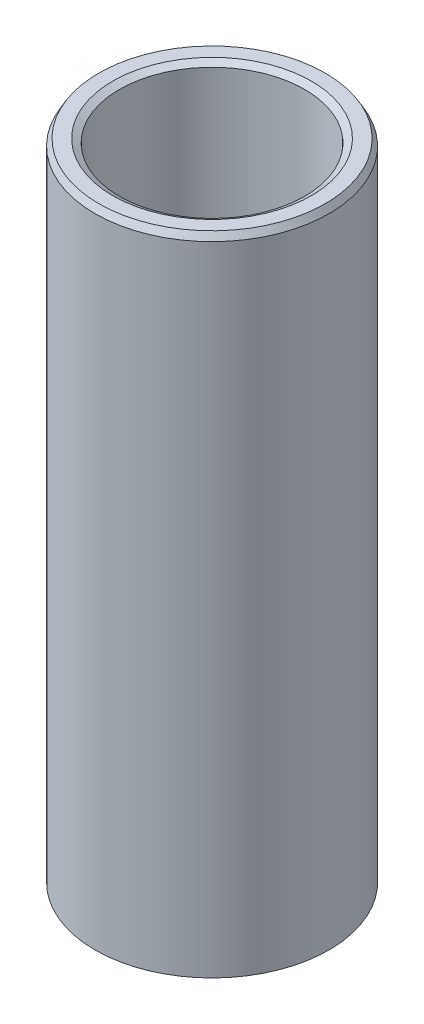
ISO-10303-21;
HEADER;
FILE_DESCRIPTION(('STEP AP214'),'2;1');
FILE_NAME('part.step','',(''),(''),'','','');
FILE_SCHEMA(('AUTOMOTIVE_DESIGN { 1 0 10303 214 1 1 1 1 }'));
ENDSEC;
DATA;
#1=APPLICATION_CONTEXT('core data for automotive mechanical design processes');
#2=APPLICATION_PROTOCOL_DEFINITION('international standard','automotive_design',2000,#1);
#3=PRODUCT_CONTEXT('',#1,'mechanical');
#4=PRODUCT('Part','Part','',(#3));
#5=PRODUCT_RELATED_PRODUCT_CATEGORY('part','',(#4));
#6=PRODUCT_DEFINITION_FORMATION('','',#4);
#7=PRODUCT_DEFINITION_CONTEXT('part definition',#1,'design');
#8=PRODUCT_DEFINITION('design','',#6,#7);
#9=PRODUCT_DEFINITION_SHAPE('','',#8);
#10=(LENGTH_UNIT() NAMED_UNIT(*) SI_UNIT(.MILLI.,.METRE.));
#11=(NAMED_UNIT(*) PLANE_ANGLE_UNIT() SI_UNIT($,.RADIAN.));
#12=(NAMED_UNIT(*) SI_UNIT($,.STERADIAN.) SOLID_ANGLE_UNIT());
#13=UNCERTAINTY_MEASURE_WITH_UNIT(LENGTH_MEASURE(1.E-05),#10,'distance_accuracy_value','');
#14=(GEOMETRIC_REPRESENTATION_CONTEXT(3) GLOBAL_UNCERTAINTY_ASSIGNED_CONTEXT((#13)) GLOBAL_UNIT_ASSIGNED_CONTEXT((#10,
#11,#12)) REPRESENTATION_CONTEXT('',''));
#15=CARTESIAN_POINT('',(0.,0.,0.));
#16=DIRECTION('',(0.,0.,1.));
#17=DIRECTION('',(1.,0.,0.));
#18=AXIS2_PLACEMENT_3D('',#15,#16,#17);
#19=CARTESIAN_POINT('',(0.,276.908699703213,0.));
#20=DIRECTION('',(0.,-1.,0.));
#21=DIRECTION('',(0.,0.,-1.));
#22=AXIS2_PLACEMENT_3D('',#19,#20,#21);
#23=CYLINDRICAL_SURFACE('',#22,50.);
#24=CARTESIAN_POINT('',(0.,1.64700059738854,0.));
#25=DIRECTION('',(0.,1.,0.));
#26=DIRECTION('',(0.,0.,1.));
#27=AXIS2_PLACEMENT_3D('',#24,#25,#26);
#28=CIRCLE('',#27,50.);
#29=CARTESIAN_POINT('',(0.,1.64700059738854,50.));
#30=VERTEX_POINT('',#29);
#31=EDGE_CURVE('E10',#30,#30,#28,.T.);
#32=ORIENTED_EDGE('',*,*,#31,.T.);
#33=EDGE_LOOP('',(#32));
#34=FACE_BOUND('',#33,.T.);
#35=CARTESIAN_POINT('',(0.,274.05601098844,0.));
#36=DIRECTION('',(0.,1.,0.));
#37=DIRECTION('',(0.,0.,1.));
#38=AXIS2_PLACEMENT_3D('',#35,#36,#37);
#39=CIRCLE('',#38,50.);
#40=CARTESIAN_POINT('',(0.,274.05601098844,50.));
#41=VERTEX_POINT('',#40);
#42=EDGE_CURVE('E50',#41,#41,#39,.F.);
#43=ORIENTED_EDGE('',*,*,#42,.T.);
#44=EDGE_LOOP('',(#43));
#45=FACE_BOUND('',#44,.T.);
#46=ADVANCED_FACE('F39',(#34,#45),#23,.T.);
#47=CARTESIAN_POINT('',(0.,276.908699703213,0.));
#48=DIRECTION('',(0.,1.,0.));
#49=DIRECTION('',(0.,0.,1.));
#50=AXIS2_PLACEMENT_3D('',#47,#48,#49);
#51=PLANE('',#50);
#52=CARTESIAN_POINT('',(0.,276.908699703213,0.));
#53=DIRECTION('',(0.,1.,0.));
#54=DIRECTION('',(0.,0.,1.));
#55=AXIS2_PLACEMENT_3D('',#52,#53,#54);
#56=CIRCLE('',#55,42.4172819836385);
#57=CARTESIAN_POINT('',(0.,276.908699703213,42.4172819836385));
#58=VERTEX_POINT('',#57);
#59=EDGE_CURVE('E58',#58,#58,#56,.F.);
#60=ORIENTED_EDGE('',*,*,#59,.T.);
#61=EDGE_LOOP('',(#60));
#62=FACE_BOUND('',#61,.T.);
#63=CARTESIAN_POINT('',(0.,276.908699703213,0.));
#64=DIRECTION('',(0.,1.,0.));
#65=DIRECTION('',(0.,0.,1.));
#66=AXIS2_PLACEMENT_3D('',#63,#64,#65);
#67=CIRCLE('',#66,48.3529994026114);
#68=CARTESIAN_POINT('',(0.,276.908699703213,48.3529994026114));
#69=VERTEX_POINT('',#68);
#70=EDGE_CURVE('E61',#69,#69,#67,.T.);
#71=ORIENTED_EDGE('',*,*,#70,.T.);
#72=EDGE_LOOP('',(#71));
#73=FACE_BOUND('',#72,.T.);
#74=ADVANCED_FACE('F88',(#62,#73),#51,.T.);
#75=CARTESIAN_POINT('',(0.,0.,0.));
#76=DIRECTION('',(0.,1.,0.));
#77=DIRECTION('',(0.,0.,1.));
#78=AXIS2_PLACEMENT_3D('',#75,#76,#77);
#79=PLANE('',#78);
#80=CARTESIAN_POINT('',(0.,0.,0.));
#81=DIRECTION('',(0.,1.,0.));
#82=DIRECTION('',(0.,0.,1.));
#83=AXIS2_PLACEMENT_3D('',#80,#81,#82);
#84=CIRCLE('',#83,41.2115938662539);
#85=CARTESIAN_POINT('',(0.,0.,41.2115938662539));
#86=VERTEX_POINT('',#85);
#87=EDGE_CURVE('E51',#86,#86,#84,.T.);
#88=ORIENTED_EDGE('',*,*,#87,.T.);
#89=EDGE_LOOP('',(#88));
#90=FACE_BOUND('',#89,.T.);
#91=CARTESIAN_POINT('',(0.,0.,0.));
#92=DIRECTION('',(0.,1.,0.));
#93=DIRECTION('',(0.,0.,1.));
#94=AXIS2_PLACEMENT_3D('',#91,#92,#93);
#95=CIRCLE('',#94,47.1473112852268);
#96=CARTESIAN_POINT('',(0.,0.,47.1473112852268));
#97=VERTEX_POINT('',#96);
#98=EDGE_CURVE('E54',#97,#97,#95,.F.);
#99=ORIENTED_EDGE('',*,*,#98,.T.);
#100=EDGE_LOOP('',(#99));
#101=FACE_BOUND('',#100,.T.);
#102=ADVANCED_FACE('F83',(#90,#101),#79,.F.);
#103=CARTESIAN_POINT('',(0.,276.908699703213,0.));
#104=DIRECTION('',(0.,-1.,0.));
#105=DIRECTION('',(0.,0.,-1.));
#106=AXIS2_PLACEMENT_3D('',#103,#104,#105);
#107=CYLINDRICAL_SURFACE('',#106,39.5645932688654);
#108=CARTESIAN_POINT('',(0.,275.261699105825,0.));
#109=DIRECTION('',(0.,1.,0.));
#110=DIRECTION('',(0.,0.,1.));
#111=AXIS2_PLACEMENT_3D('',#108,#109,#110);
#112=CIRCLE('',#111,39.5645932688654);
#113=CARTESIAN_POINT('',(0.,275.261699105825,39.5645932688654));
#114=VERTEX_POINT('',#113);
#115=EDGE_CURVE('E67',#114,#114,#112,.T.);
#116=ORIENTED_EDGE('',*,*,#115,.T.);
#117=EDGE_LOOP('',(#116));
#118=FACE_BOUND('',#117,.T.);
#119=CARTESIAN_POINT('',(0.,2.85268871477329,0.));
#120=DIRECTION('',(0.,1.,0.));
#121=DIRECTION('',(0.,0.,1.));
#122=AXIS2_PLACEMENT_3D('',#119,#120,#121);
#123=CIRCLE('',#122,39.5645932688654);
#124=CARTESIAN_POINT('',(0.,2.85268871477329,39.5645932688654));
#125=VERTEX_POINT('',#124);
#126=EDGE_CURVE('E69',#125,#125,#123,.F.);
#127=ORIENTED_EDGE('',*,*,#126,.T.);
#128=EDGE_LOOP('',(#127));
#129=FACE_BOUND('',#128,.T.);
#130=ADVANCED_FACE('F71',(#118,#129),#107,.F.);
#131=CARTESIAN_POINT('',(0.,275.261699105825,0.));
#132=DIRECTION('',(0.,1.,0.));
#133=DIRECTION('',(0.,0.,1.));
#134=AXIS2_PLACEMENT_3D('',#131,#132,#133);
#135=CONICAL_SURFACE('',#134,39.5645932688654,1.0471975511966);
#136=ORIENTED_EDGE('',*,*,#59,.F.);
#137=EDGE_LOOP('',(#136));
#138=FACE_BOUND('',#137,.T.);
#139=ORIENTED_EDGE('',*,*,#115,.F.);
#140=EDGE_LOOP('',(#139));
#141=FACE_BOUND('',#140,.T.);
#142=ADVANCED_FACE('F77',(#138,#141),#135,.F.);
#143=CARTESIAN_POINT('',(0.,0.,0.));
#144=DIRECTION('',(0.,-1.,0.));
#145=DIRECTION('',(0.,0.,-1.));
#146=AXIS2_PLACEMENT_3D('',#143,#144,#145);
#147=CONICAL_SURFACE('',#146,41.2115938662539,0.523598775598293);
#148=ORIENTED_EDGE('',*,*,#126,.F.);
#149=EDGE_LOOP('',(#148));
#150=FACE_BOUND('',#149,.T.);
#151=ORIENTED_EDGE('',*,*,#87,.F.);
#152=EDGE_LOOP('',(#151));
#153=FACE_BOUND('',#152,.T.);
#154=ADVANCED_FACE('F73',(#150,#153),#147,.F.);
#155=CARTESIAN_POINT('',(0.,1.64700059738854,0.));
#156=DIRECTION('',(0.,1.,0.));
#157=DIRECTION('',(0.,0.,1.));
#158=AXIS2_PLACEMENT_3D('',#155,#156,#157);
#159=CONICAL_SURFACE('',#158,50.,1.0471975511966);
#160=ORIENTED_EDGE('',*,*,#98,.F.);
#161=EDGE_LOOP('',(#160));
#162=FACE_BOUND('',#161,.T.);
#163=ORIENTED_EDGE('',*,*,#31,.F.);
#164=EDGE_LOOP('',(#163));
#165=FACE_BOUND('',#164,.T.);
#166=ADVANCED_FACE('F76',(#162,#165),#159,.T.);
#167=CARTESIAN_POINT('',(0.,276.908699703213,0.));
#168=DIRECTION('',(0.,-1.,0.));
#169=DIRECTION('',(0.,0.,-1.));
#170=AXIS2_PLACEMENT_3D('',#167,#168,#169);
#171=CONICAL_SURFACE('',#170,48.3529994026114,0.523598775598301);
#172=ORIENTED_EDGE('',*,*,#42,.F.);
#173=EDGE_LOOP('',(#172));
#174=FACE_BOUND('',#173,.T.);
#175=ORIENTED_EDGE('',*,*,#70,.F.);
#176=EDGE_LOOP('',(#175));
#177=FACE_BOUND('',#176,.T.);
#178=ADVANCED_FACE('F45',(#174,#177),#171,.T.);
#179=CLOSED_SHELL('',(#46,#74,#102,#130,#142,#154,#166,#178));
#180=MANIFOLD_SOLID_BREP('B2',#179);
#181=ADVANCED_BREP_SHAPE_REPRESENTATION('',(#18,#180),#14);
#182=SHAPE_DEFINITION_REPRESENTATION(#9,#181);
ENDSEC;
END-ISO-10303-21;
